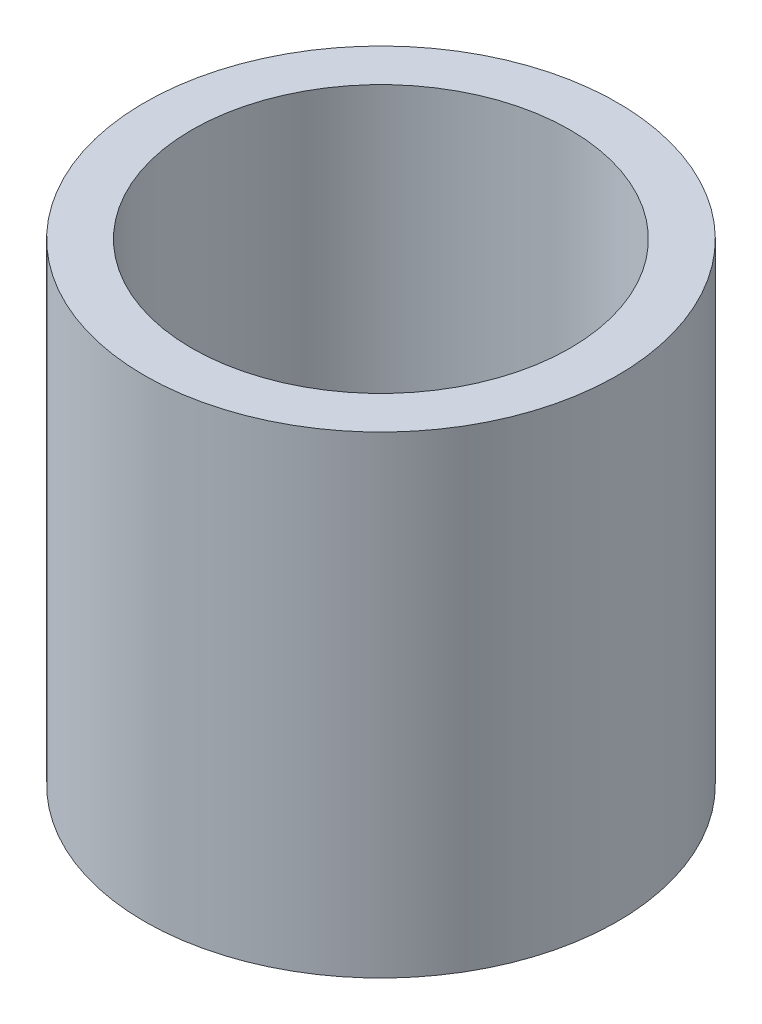
ISO-10303-21;
HEADER;
FILE_DESCRIPTION(('STEP AP214'),'2;1');
FILE_NAME('part.step','',(''),(''),'','','');
FILE_SCHEMA(('AUTOMOTIVE_DESIGN { 1 0 10303 214 1 1 1 1 }'));
ENDSEC;
DATA;
#1=APPLICATION_CONTEXT('core data for automotive mechanical design processes');
#2=APPLICATION_PROTOCOL_DEFINITION('international standard','automotive_design',2000,#1);
#3=PRODUCT_CONTEXT('',#1,'mechanical');
#4=PRODUCT('Part','Part','',(#3));
#5=PRODUCT_RELATED_PRODUCT_CATEGORY('part','',(#4));
#6=PRODUCT_DEFINITION_FORMATION('','',#4);
#7=PRODUCT_DEFINITION_CONTEXT('part definition',#1,'design');
#8=PRODUCT_DEFINITION('design','',#6,#7);
#9=PRODUCT_DEFINITION_SHAPE('','',#8);
#10=(LENGTH_UNIT() NAMED_UNIT(*) SI_UNIT(.MILLI.,.METRE.));
#11=(NAMED_UNIT(*) PLANE_ANGLE_UNIT() SI_UNIT($,.RADIAN.));
#12=(NAMED_UNIT(*) SI_UNIT($,.STERADIAN.) SOLID_ANGLE_UNIT());
#13=UNCERTAINTY_MEASURE_WITH_UNIT(LENGTH_MEASURE(1.E-05),#10,'distance_accuracy_value','');
#14=(GEOMETRIC_REPRESENTATION_CONTEXT(3) GLOBAL_UNCERTAINTY_ASSIGNED_CONTEXT((#13)) GLOBAL_UNIT_ASSIGNED_CONTEXT((#10,
#11,#12)) REPRESENTATION_CONTEXT('',''));
#15=CARTESIAN_POINT('',(0.,0.,0.));
#16=DIRECTION('',(0.,0.,1.));
#17=DIRECTION('',(1.,0.,0.));
#18=AXIS2_PLACEMENT_3D('',#15,#16,#17);
#19=CARTESIAN_POINT('',(0.,10.,0.));
#20=DIRECTION('',(0.,1.,0.));
#21=DIRECTION('',(0.,0.,1.));
#22=AXIS2_PLACEMENT_3D('',#19,#20,#21);
#23=PLANE('',#22);
#24=CARTESIAN_POINT('',(0.,10.,0.));
#25=DIRECTION('',(0.,1.,0.));
#26=DIRECTION('',(0.,0.,1.));
#27=AXIS2_PLACEMENT_3D('',#24,#25,#26);
#28=CIRCLE('',#27,5.);
#29=CARTESIAN_POINT('',(0.,10.,5.));
#30=VERTEX_POINT('',#29);
#31=EDGE_CURVE('E10',#30,#30,#28,.T.);
#32=ORIENTED_EDGE('',*,*,#31,.T.);
#33=EDGE_LOOP('',(#32));
#34=FACE_BOUND('',#33,.T.);
#35=CARTESIAN_POINT('',(0.,10.,0.));
#36=DIRECTION('',(0.,1.,0.));
#37=DIRECTION('',(0.,0.,1.));
#38=AXIS2_PLACEMENT_3D('',#35,#36,#37);
#39=CIRCLE('',#38,4.);
#40=CARTESIAN_POINT('',(0.,10.,4.));
#41=VERTEX_POINT('',#40);
#42=EDGE_CURVE('E42',#41,#41,#39,.T.);
#43=ORIENTED_EDGE('',*,*,#42,.F.);
#44=EDGE_LOOP('',(#43));
#45=FACE_BOUND('',#44,.T.);
#46=ADVANCED_FACE('F31',(#34,#45),#23,.T.);
#47=CARTESIAN_POINT('',(0.,0.,0.));
#48=DIRECTION('',(0.,1.,0.));
#49=DIRECTION('',(0.,0.,1.));
#50=AXIS2_PLACEMENT_3D('',#47,#48,#49);
#51=PLANE('',#50);
#52=CARTESIAN_POINT('',(0.,0.,0.));
#53=DIRECTION('',(0.,1.,0.));
#54=DIRECTION('',(0.,0.,1.));
#55=AXIS2_PLACEMENT_3D('',#52,#53,#54);
#56=CIRCLE('',#55,5.);
#57=CARTESIAN_POINT('',(0.,0.,5.));
#58=VERTEX_POINT('',#57);
#59=EDGE_CURVE('E35',#58,#58,#56,.T.);
#60=ORIENTED_EDGE('',*,*,#59,.F.);
#61=EDGE_LOOP('',(#60));
#62=FACE_BOUND('',#61,.T.);
#63=CARTESIAN_POINT('',(0.,0.,0.));
#64=DIRECTION('',(0.,1.,0.));
#65=DIRECTION('',(0.,0.,1.));
#66=AXIS2_PLACEMENT_3D('',#63,#64,#65);
#67=CIRCLE('',#66,4.);
#68=CARTESIAN_POINT('',(0.,0.,4.));
#69=VERTEX_POINT('',#68);
#70=EDGE_CURVE('E44',#69,#69,#67,.T.);
#71=ORIENTED_EDGE('',*,*,#70,.T.);
#72=EDGE_LOOP('',(#71));
#73=FACE_BOUND('',#72,.T.);
#74=ADVANCED_FACE('F54',(#62,#73),#51,.F.);
#75=CARTESIAN_POINT('',(0.,10.,0.));
#76=DIRECTION('',(0.,-1.,0.));
#77=DIRECTION('',(0.,0.,-1.));
#78=AXIS2_PLACEMENT_3D('',#75,#76,#77);
#79=CYLINDRICAL_SURFACE('',#78,5.);
#80=ORIENTED_EDGE('',*,*,#31,.F.);
#81=EDGE_LOOP('',(#80));
#82=FACE_BOUND('',#81,.T.);
#83=ORIENTED_EDGE('',*,*,#59,.T.);
#84=EDGE_LOOP('',(#83));
#85=FACE_BOUND('',#84,.T.);
#86=ADVANCED_FACE('F33',(#82,#85),#79,.T.);
#87=CARTESIAN_POINT('',(0.,10.,0.));
#88=DIRECTION('',(0.,-1.,0.));
#89=DIRECTION('',(0.,0.,-1.));
#90=AXIS2_PLACEMENT_3D('',#87,#88,#89);
#91=CYLINDRICAL_SURFACE('',#90,4.);
#92=ORIENTED_EDGE('',*,*,#42,.T.);
#93=EDGE_LOOP('',(#92));
#94=FACE_BOUND('',#93,.T.);
#95=ORIENTED_EDGE('',*,*,#70,.F.);
#96=EDGE_LOOP('',(#95));
#97=FACE_BOUND('',#96,.T.);
#98=ADVANCED_FACE('F50',(#94,#97),#91,.F.);
#99=CLOSED_SHELL('',(#46,#74,#86,#98));
#100=MANIFOLD_SOLID_BREP('B2',#99);
#101=ADVANCED_BREP_SHAPE_REPRESENTATION('',(#18,#100),#14);
#102=SHAPE_DEFINITION_REPRESENTATION(#9,#101);
ENDSEC;
END-ISO-10303-21;
